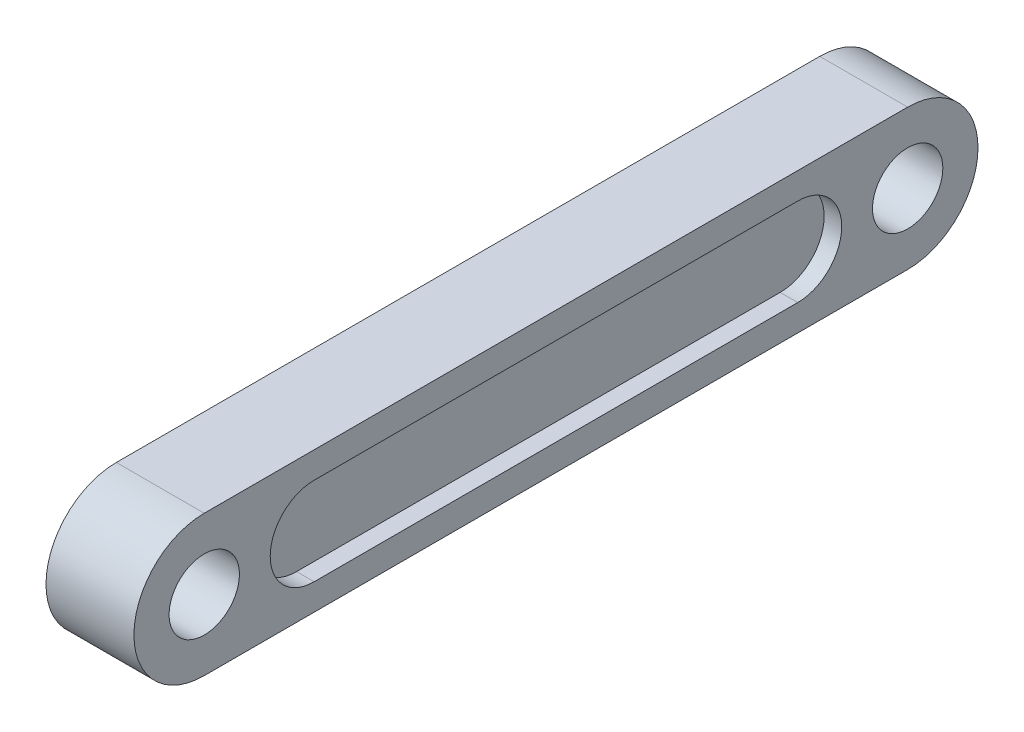
ISO-10303-21;
HEADER;
FILE_DESCRIPTION(('STEP AP214'),'2;1');
FILE_NAME('part.step','',(''),(''),'','','');
FILE_SCHEMA(('AUTOMOTIVE_DESIGN { 1 0 10303 214 1 1 1 1 }'));
ENDSEC;
DATA;
#1=APPLICATION_CONTEXT('core data for automotive mechanical design processes');
#2=APPLICATION_PROTOCOL_DEFINITION('international standard','automotive_design',2000,#1);
#3=PRODUCT_CONTEXT('',#1,'mechanical');
#4=PRODUCT('Part','Part','',(#3));
#5=PRODUCT_RELATED_PRODUCT_CATEGORY('part','',(#4));
#6=PRODUCT_DEFINITION_FORMATION('','',#4);
#7=PRODUCT_DEFINITION_CONTEXT('part definition',#1,'design');
#8=PRODUCT_DEFINITION('design','',#6,#7);
#9=PRODUCT_DEFINITION_SHAPE('','',#8);
#10=(LENGTH_UNIT() NAMED_UNIT(*) SI_UNIT(.MILLI.,.METRE.));
#11=(NAMED_UNIT(*) PLANE_ANGLE_UNIT() SI_UNIT($,.RADIAN.));
#12=(NAMED_UNIT(*) SI_UNIT($,.STERADIAN.) SOLID_ANGLE_UNIT());
#13=UNCERTAINTY_MEASURE_WITH_UNIT(LENGTH_MEASURE(1.E-05),#10,'distance_accuracy_value','');
#14=(GEOMETRIC_REPRESENTATION_CONTEXT(3) GLOBAL_UNCERTAINTY_ASSIGNED_CONTEXT((#13)) GLOBAL_UNIT_ASSIGNED_CONTEXT((#10,
#11,#12)) REPRESENTATION_CONTEXT('',''));
#15=CARTESIAN_POINT('',(0.,0.,0.));
#16=DIRECTION('',(0.,0.,1.));
#17=DIRECTION('',(1.,0.,0.));
#18=AXIS2_PLACEMENT_3D('',#15,#16,#17);
#19=CARTESIAN_POINT('',(5.,0.,0.));
#20=DIRECTION('',(1.,0.,0.));
#21=DIRECTION('',(0.,0.,-1.));
#22=AXIS2_PLACEMENT_3D('',#19,#20,#21);
#23=PLANE('',#22);
#24=CARTESIAN_POINT('',(5.,0.,-40.));
#25=DIRECTION('',(1.,0.,0.));
#26=DIRECTION('',(0.,0.,-1.));
#27=AXIS2_PLACEMENT_3D('',#24,#25,#26);
#28=CIRCLE('',#27,4.00000000000001);
#29=CARTESIAN_POINT('',(5.,0.,-44.));
#30=VERTEX_POINT('',#29);
#31=EDGE_CURVE('E195',#30,#30,#28,.F.);
#32=ORIENTED_EDGE('',*,*,#31,.T.);
#33=EDGE_LOOP('',(#32));
#34=FACE_BOUND('',#33,.T.);
#35=CARTESIAN_POINT('',(5.,0.,40.));
#36=DIRECTION('',(1.,0.,0.));
#37=DIRECTION('',(0.,0.,-1.));
#38=AXIS2_PLACEMENT_3D('',#35,#36,#37);
#39=CIRCLE('',#38,4.00000000000001);
#40=CARTESIAN_POINT('',(5.,0.,36.));
#41=VERTEX_POINT('',#40);
#42=EDGE_CURVE('E198',#41,#41,#39,.T.);
#43=ORIENTED_EDGE('',*,*,#42,.F.);
#44=EDGE_LOOP('',(#43));
#45=FACE_BOUND('',#44,.T.);
#46=DIRECTION('',(0.,0.,-1.));
#47=VECTOR('',#46,1.);
#48=CARTESIAN_POINT('',(5.,-7.99999999999999,0.));
#49=LINE('',#48,#47);
#50=CARTESIAN_POINT('',(5.,-7.99999999999999,40.));
#51=VERTEX_POINT('',#50);
#52=CARTESIAN_POINT('',(5.,-7.99999999999999,-40.));
#53=VERTEX_POINT('',#52);
#54=EDGE_CURVE('E202',#51,#53,#49,.T.);
#55=ORIENTED_EDGE('',*,*,#54,.T.);
#56=CARTESIAN_POINT('',(5.,0.,-40.));
#57=DIRECTION('',(1.,0.,0.));
#58=DIRECTION('',(0.,0.,-1.));
#59=AXIS2_PLACEMENT_3D('',#56,#57,#58);
#60=CIRCLE('',#59,7.99999999999999);
#61=CARTESIAN_POINT('',(5.,7.99999999999998,-40.));
#62=VERTEX_POINT('',#61);
#63=EDGE_CURVE('E205',#53,#62,#60,.T.);
#64=ORIENTED_EDGE('',*,*,#63,.T.);
#65=DIRECTION('',(0.,0.,-1.));
#66=VECTOR('',#65,1.);
#67=CARTESIAN_POINT('',(5.,7.99999999999998,0.));
#68=LINE('',#67,#66);
#69=CARTESIAN_POINT('',(5.,7.99999999999998,40.));
#70=VERTEX_POINT('',#69);
#71=EDGE_CURVE('E207',#70,#62,#68,.T.);
#72=ORIENTED_EDGE('',*,*,#71,.F.);
#73=CARTESIAN_POINT('',(5.,0.,40.));
#74=DIRECTION('',(1.,0.,0.));
#75=DIRECTION('',(0.,0.,-1.));
#76=AXIS2_PLACEMENT_3D('',#73,#74,#75);
#77=CIRCLE('',#76,7.99999999999999);
#78=EDGE_CURVE('E210',#51,#70,#77,.F.);
#79=ORIENTED_EDGE('',*,*,#78,.F.);
#80=EDGE_LOOP('',(#55,#64,#72,#79));
#81=FACE_BOUND('',#80,.T.);
#82=DIRECTION('',(0.,0.,-1.));
#83=VECTOR('',#82,1.);
#84=CARTESIAN_POINT('',(5.,5.,-27.5));
#85=LINE('',#84,#83);
#86=CARTESIAN_POINT('',(5.,5.,27.5));
#87=VERTEX_POINT('',#86);
#88=CARTESIAN_POINT('',(5.,5.,-27.5));
#89=VERTEX_POINT('',#88);
#90=EDGE_CURVE('E155',#87,#89,#85,.T.);
#91=ORIENTED_EDGE('',*,*,#90,.T.);
#92=CARTESIAN_POINT('',(5.,0.,-27.5));
#93=DIRECTION('',(-1.,0.,0.));
#94=DIRECTION('',(0.,0.,1.));
#95=AXIS2_PLACEMENT_3D('',#92,#93,#94);
#96=CIRCLE('',#95,5.);
#97=CARTESIAN_POINT('',(5.,-5.,-27.5));
#98=VERTEX_POINT('',#97);
#99=EDGE_CURVE('E52',#89,#98,#96,.T.);
#100=ORIENTED_EDGE('',*,*,#99,.T.);
#101=DIRECTION('',(0.,0.,1.));
#102=VECTOR('',#101,1.);
#103=CARTESIAN_POINT('',(5.,-5.,-27.5));
#104=LINE('',#103,#102);
#105=CARTESIAN_POINT('',(5.,-4.99999999999999,27.5));
#106=VERTEX_POINT('',#105);
#107=EDGE_CURVE('E146',#98,#106,#104,.T.);
#108=ORIENTED_EDGE('',*,*,#107,.T.);
#109=CARTESIAN_POINT('',(5.,0.,27.5));
#110=DIRECTION('',(-1.,0.,0.));
#111=DIRECTION('',(0.,0.,1.));
#112=AXIS2_PLACEMENT_3D('',#109,#110,#111);
#113=CIRCLE('',#112,5.);
#114=EDGE_CURVE('E149',#106,#87,#113,.T.);
#115=ORIENTED_EDGE('',*,*,#114,.T.);
#116=EDGE_LOOP('',(#91,#100,#108,#115));
#117=FACE_BOUND('',#116,.T.);
#118=ADVANCED_FACE('F37',(#34,#45,#81,#117),#23,.T.);
#119=CARTESIAN_POINT('',(5.,-7.99999999999999,0.));
#120=DIRECTION('',(0.,1.,0.));
#121=DIRECTION('',(0.,0.,1.));
#122=AXIS2_PLACEMENT_3D('',#119,#120,#121);
#123=PLANE('',#122);
#124=DIRECTION('',(0.,0.,-1.));
#125=VECTOR('',#124,1.);
#126=CARTESIAN_POINT('',(-5.,-7.99999999999999,0.));
#127=LINE('',#126,#125);
#128=CARTESIAN_POINT('',(-5.,-7.99999999999999,40.));
#129=VERTEX_POINT('',#128);
#130=CARTESIAN_POINT('',(-5.,-7.99999999999999,-40.));
#131=VERTEX_POINT('',#130);
#132=EDGE_CURVE('E219',#129,#131,#127,.T.);
#133=ORIENTED_EDGE('',*,*,#132,.T.);
#134=DIRECTION('',(-1.,0.,0.));
#135=VECTOR('',#134,1.);
#136=CARTESIAN_POINT('',(5.,-7.99999999999999,-40.));
#137=LINE('',#136,#135);
#138=EDGE_CURVE('E11',#53,#131,#137,.T.);
#139=ORIENTED_EDGE('',*,*,#138,.F.);
#140=ORIENTED_EDGE('',*,*,#54,.F.);
#141=DIRECTION('',(-1.,0.,0.));
#142=VECTOR('',#141,1.);
#143=CARTESIAN_POINT('',(5.,-7.99999999999999,40.));
#144=LINE('',#143,#142);
#145=EDGE_CURVE('E213',#51,#129,#144,.T.);
#146=ORIENTED_EDGE('',*,*,#145,.T.);
#147=EDGE_LOOP('',(#133,#139,#140,#146));
#148=FACE_BOUND('',#147,.T.);
#149=ADVANCED_FACE('F251',(#148),#123,.F.);
#150=CARTESIAN_POINT('',(5.,0.,-40.));
#151=DIRECTION('',(-1.,0.,0.));
#152=DIRECTION('',(0.,0.,1.));
#153=AXIS2_PLACEMENT_3D('',#150,#151,#152);
#154=CYLINDRICAL_SURFACE('',#153,7.99999999999999);
#155=CARTESIAN_POINT('',(-5.,0.,-40.));
#156=DIRECTION('',(1.,0.,0.));
#157=DIRECTION('',(0.,0.,-1.));
#158=AXIS2_PLACEMENT_3D('',#155,#156,#157);
#159=CIRCLE('',#158,7.99999999999999);
#160=CARTESIAN_POINT('',(-5.,7.99999999999998,-40.));
#161=VERTEX_POINT('',#160);
#162=EDGE_CURVE('E222',#131,#161,#159,.T.);
#163=ORIENTED_EDGE('',*,*,#162,.T.);
#164=DIRECTION('',(-1.,0.,0.));
#165=VECTOR('',#164,1.);
#166=CARTESIAN_POINT('',(5.,7.99999999999998,-40.));
#167=LINE('',#166,#165);
#168=EDGE_CURVE('E45',#62,#161,#167,.T.);
#169=ORIENTED_EDGE('',*,*,#168,.F.);
#170=ORIENTED_EDGE('',*,*,#63,.F.);
#171=ORIENTED_EDGE('',*,*,#138,.T.);
#172=EDGE_LOOP('',(#163,#169,#170,#171));
#173=FACE_BOUND('',#172,.T.);
#174=ADVANCED_FACE('F238',(#173),#154,.T.);
#175=CARTESIAN_POINT('',(5.,7.99999999999998,0.));
#176=DIRECTION('',(0.,1.,0.));
#177=DIRECTION('',(0.,0.,1.));
#178=AXIS2_PLACEMENT_3D('',#175,#176,#177);
#179=PLANE('',#178);
#180=DIRECTION('',(0.,0.,-1.));
#181=VECTOR('',#180,1.);
#182=CARTESIAN_POINT('',(-5.,7.99999999999998,0.));
#183=LINE('',#182,#181);
#184=CARTESIAN_POINT('',(-5.,7.99999999999998,40.));
#185=VERTEX_POINT('',#184);
#186=EDGE_CURVE('E225',#185,#161,#183,.T.);
#187=ORIENTED_EDGE('',*,*,#186,.F.);
#188=DIRECTION('',(-1.,0.,0.));
#189=VECTOR('',#188,1.);
#190=CARTESIAN_POINT('',(5.,7.99999999999998,40.));
#191=LINE('',#190,#189);
#192=EDGE_CURVE('E231',#70,#185,#191,.T.);
#193=ORIENTED_EDGE('',*,*,#192,.F.);
#194=ORIENTED_EDGE('',*,*,#71,.T.);
#195=ORIENTED_EDGE('',*,*,#168,.T.);
#196=EDGE_LOOP('',(#187,#193,#194,#195));
#197=FACE_BOUND('',#196,.T.);
#198=ADVANCED_FACE('F235',(#197),#179,.T.);
#199=CARTESIAN_POINT('',(5.,0.,40.));
#200=DIRECTION('',(-1.,0.,0.));
#201=DIRECTION('',(0.,0.,1.));
#202=AXIS2_PLACEMENT_3D('',#199,#200,#201);
#203=CYLINDRICAL_SURFACE('',#202,4.00000000000001);
#204=ORIENTED_EDGE('',*,*,#42,.T.);
#205=EDGE_LOOP('',(#204));
#206=FACE_BOUND('',#205,.T.);
#207=CARTESIAN_POINT('',(-5.,0.,40.));
#208=DIRECTION('',(1.,0.,0.));
#209=DIRECTION('',(0.,0.,-1.));
#210=AXIS2_PLACEMENT_3D('',#207,#208,#209);
#211=CIRCLE('',#210,4.00000000000001);
#212=CARTESIAN_POINT('',(-5.,0.,36.));
#213=VERTEX_POINT('',#212);
#214=EDGE_CURVE('E216',#213,#213,#211,.T.);
#215=ORIENTED_EDGE('',*,*,#214,.F.);
#216=EDGE_LOOP('',(#215));
#217=FACE_BOUND('',#216,.T.);
#218=ADVANCED_FACE('F262',(#206,#217),#203,.F.);
#219=CARTESIAN_POINT('',(5.,0.,-40.));
#220=DIRECTION('',(-1.,0.,0.));
#221=DIRECTION('',(0.,0.,1.));
#222=AXIS2_PLACEMENT_3D('',#219,#220,#221);
#223=CYLINDRICAL_SURFACE('',#222,4.00000000000001);
#224=ORIENTED_EDGE('',*,*,#31,.F.);
#225=EDGE_LOOP('',(#224));
#226=FACE_BOUND('',#225,.T.);
#227=CARTESIAN_POINT('',(-5.,0.,-40.));
#228=DIRECTION('',(1.,0.,0.));
#229=DIRECTION('',(0.,0.,-1.));
#230=AXIS2_PLACEMENT_3D('',#227,#228,#229);
#231=CIRCLE('',#230,4.00000000000001);
#232=CARTESIAN_POINT('',(-5.,0.,-44.));
#233=VERTEX_POINT('',#232);
#234=EDGE_CURVE('E189',#233,#233,#231,.F.);
#235=ORIENTED_EDGE('',*,*,#234,.T.);
#236=EDGE_LOOP('',(#235));
#237=FACE_BOUND('',#236,.T.);
#238=ADVANCED_FACE('F39',(#226,#237),#223,.F.);
#239=CARTESIAN_POINT('',(5.,0.,40.));
#240=DIRECTION('',(-1.,0.,0.));
#241=DIRECTION('',(0.,0.,1.));
#242=AXIS2_PLACEMENT_3D('',#239,#240,#241);
#243=CYLINDRICAL_SURFACE('',#242,7.99999999999999);
#244=CARTESIAN_POINT('',(-5.,0.,40.));
#245=DIRECTION('',(1.,0.,0.));
#246=DIRECTION('',(0.,0.,-1.));
#247=AXIS2_PLACEMENT_3D('',#244,#245,#246);
#248=CIRCLE('',#247,7.99999999999999);
#249=EDGE_CURVE('E199',#129,#185,#248,.F.);
#250=ORIENTED_EDGE('',*,*,#249,.F.);
#251=ORIENTED_EDGE('',*,*,#145,.F.);
#252=ORIENTED_EDGE('',*,*,#78,.T.);
#253=ORIENTED_EDGE('',*,*,#192,.T.);
#254=EDGE_LOOP('',(#250,#251,#252,#253));
#255=FACE_BOUND('',#254,.T.);
#256=ADVANCED_FACE('F245',(#255),#243,.T.);
#257=CARTESIAN_POINT('',(-5.,0.,0.));
#258=DIRECTION('',(1.,0.,0.));
#259=DIRECTION('',(0.,0.,-1.));
#260=AXIS2_PLACEMENT_3D('',#257,#258,#259);
#261=PLANE('',#260);
#262=DIRECTION('',(0.,0.,1.));
#263=VECTOR('',#262,1.);
#264=CARTESIAN_POINT('',(-5.,-5.,-27.5));
#265=LINE('',#264,#263);
#266=CARTESIAN_POINT('',(-5.,-5.,-27.5));
#267=VERTEX_POINT('',#266);
#268=CARTESIAN_POINT('',(-5.,-4.99999999999999,27.5));
#269=VERTEX_POINT('',#268);
#270=EDGE_CURVE('E179',#267,#269,#265,.T.);
#271=ORIENTED_EDGE('',*,*,#270,.F.);
#272=CARTESIAN_POINT('',(-5.,0.,-27.5));
#273=DIRECTION('',(-1.,0.,0.));
#274=DIRECTION('',(0.,0.,1.));
#275=AXIS2_PLACEMENT_3D('',#272,#273,#274);
#276=CIRCLE('',#275,5.);
#277=CARTESIAN_POINT('',(-5.,5.,-27.5));
#278=VERTEX_POINT('',#277);
#279=EDGE_CURVE('E60',#278,#267,#276,.T.);
#280=ORIENTED_EDGE('',*,*,#279,.F.);
#281=DIRECTION('',(0.,0.,-1.));
#282=VECTOR('',#281,1.);
#283=CARTESIAN_POINT('',(-5.,5.,-27.5));
#284=LINE('',#283,#282);
#285=CARTESIAN_POINT('',(-5.,5.,27.5));
#286=VERTEX_POINT('',#285);
#287=EDGE_CURVE('E168',#286,#278,#284,.T.);
#288=ORIENTED_EDGE('',*,*,#287,.F.);
#289=CARTESIAN_POINT('',(-5.,0.,27.5));
#290=DIRECTION('',(-1.,0.,0.));
#291=DIRECTION('',(0.,0.,1.));
#292=AXIS2_PLACEMENT_3D('',#289,#290,#291);
#293=CIRCLE('',#292,5.);
#294=EDGE_CURVE('E182',#269,#286,#293,.T.);
#295=ORIENTED_EDGE('',*,*,#294,.F.);
#296=EDGE_LOOP('',(#271,#280,#288,#295));
#297=FACE_BOUND('',#296,.T.);
#298=ORIENTED_EDGE('',*,*,#234,.F.);
#299=EDGE_LOOP('',(#298));
#300=FACE_BOUND('',#299,.T.);
#301=ORIENTED_EDGE('',*,*,#214,.T.);
#302=EDGE_LOOP('',(#301));
#303=FACE_BOUND('',#302,.T.);
#304=ORIENTED_EDGE('',*,*,#132,.F.);
#305=ORIENTED_EDGE('',*,*,#249,.T.);
#306=ORIENTED_EDGE('',*,*,#186,.T.);
#307=ORIENTED_EDGE('',*,*,#162,.F.);
#308=EDGE_LOOP('',(#304,#305,#306,#307));
#309=FACE_BOUND('',#308,.T.);
#310=ADVANCED_FACE('F242',(#297,#300,#303,#309),#261,.F.);
#311=CARTESIAN_POINT('',(-3.,0.,-27.5));
#312=DIRECTION('',(-1.,0.,0.));
#313=DIRECTION('',(0.,0.,1.));
#314=AXIS2_PLACEMENT_3D('',#311,#312,#313);
#315=CYLINDRICAL_SURFACE('',#314,5.);
#316=ORIENTED_EDGE('',*,*,#279,.T.);
#317=DIRECTION('',(-1.,0.,0.));
#318=VECTOR('',#317,1.);
#319=CARTESIAN_POINT('',(-3.,-5.,-27.5));
#320=LINE('',#319,#318);
#321=CARTESIAN_POINT('',(-3.,-5.,-27.5));
#322=VERTEX_POINT('',#321);
#323=EDGE_CURVE('E177',#322,#267,#320,.T.);
#324=ORIENTED_EDGE('',*,*,#323,.F.);
#325=CARTESIAN_POINT('',(-3.,0.,-27.5));
#326=DIRECTION('',(-1.,0.,0.));
#327=DIRECTION('',(0.,0.,1.));
#328=AXIS2_PLACEMENT_3D('',#325,#326,#327);
#329=CIRCLE('',#328,5.);
#330=CARTESIAN_POINT('',(-3.,5.,-27.5));
#331=VERTEX_POINT('',#330);
#332=EDGE_CURVE('E164',#331,#322,#329,.T.);
#333=ORIENTED_EDGE('',*,*,#332,.F.);
#334=DIRECTION('',(-1.,0.,0.));
#335=VECTOR('',#334,1.);
#336=CARTESIAN_POINT('',(-3.,5.,-27.5));
#337=LINE('',#336,#335);
#338=EDGE_CURVE('E187',#331,#278,#337,.T.);
#339=ORIENTED_EDGE('',*,*,#338,.T.);
#340=EDGE_LOOP('',(#316,#324,#333,#339));
#341=FACE_BOUND('',#340,.T.);
#342=ADVANCED_FACE('F275',(#341),#315,.F.);
#343=CARTESIAN_POINT('',(-3.,5.,-27.5));
#344=DIRECTION('',(0.,1.,0.));
#345=DIRECTION('',(0.,0.,1.));
#346=AXIS2_PLACEMENT_3D('',#343,#344,#345);
#347=PLANE('',#346);
#348=ORIENTED_EDGE('',*,*,#287,.T.);
#349=ORIENTED_EDGE('',*,*,#338,.F.);
#350=DIRECTION('',(0.,0.,-1.));
#351=VECTOR('',#350,1.);
#352=CARTESIAN_POINT('',(-3.,5.,-27.5));
#353=LINE('',#352,#351);
#354=CARTESIAN_POINT('',(-3.,5.,27.5));
#355=VERTEX_POINT('',#354);
#356=EDGE_CURVE('E174',#355,#331,#353,.T.);
#357=ORIENTED_EDGE('',*,*,#356,.F.);
#358=DIRECTION('',(-1.,0.,0.));
#359=VECTOR('',#358,1.);
#360=CARTESIAN_POINT('',(-3.,5.,27.5));
#361=LINE('',#360,#359);
#362=EDGE_CURVE('E190',#355,#286,#361,.T.);
#363=ORIENTED_EDGE('',*,*,#362,.T.);
#364=EDGE_LOOP('',(#348,#349,#357,#363));
#365=FACE_BOUND('',#364,.T.);
#366=ADVANCED_FACE('F282',(#365),#347,.F.);
#367=CARTESIAN_POINT('',(-3.,0.,27.5));
#368=DIRECTION('',(-1.,0.,0.));
#369=DIRECTION('',(0.,0.,1.));
#370=AXIS2_PLACEMENT_3D('',#367,#368,#369);
#371=CYLINDRICAL_SURFACE('',#370,5.);
#372=ORIENTED_EDGE('',*,*,#294,.T.);
#373=ORIENTED_EDGE('',*,*,#362,.F.);
#374=CARTESIAN_POINT('',(-3.,0.,27.5));
#375=DIRECTION('',(-1.,0.,0.));
#376=DIRECTION('',(0.,0.,1.));
#377=AXIS2_PLACEMENT_3D('',#374,#375,#376);
#378=CIRCLE('',#377,5.);
#379=CARTESIAN_POINT('',(-3.,-4.99999999999999,27.5));
#380=VERTEX_POINT('',#379);
#381=EDGE_CURVE('E171',#380,#355,#378,.T.);
#382=ORIENTED_EDGE('',*,*,#381,.F.);
#383=DIRECTION('',(-1.,0.,0.));
#384=VECTOR('',#383,1.);
#385=CARTESIAN_POINT('',(-3.,-4.99999999999999,27.5));
#386=LINE('',#385,#384);
#387=EDGE_CURVE('E192',#380,#269,#386,.T.);
#388=ORIENTED_EDGE('',*,*,#387,.T.);
#389=EDGE_LOOP('',(#372,#373,#382,#388));
#390=FACE_BOUND('',#389,.T.);
#391=ADVANCED_FACE('F292',(#390),#371,.F.);
#392=CARTESIAN_POINT('',(-3.,-5.,-27.5));
#393=DIRECTION('',(0.,-1.,0.));
#394=DIRECTION('',(0.,0.,-1.));
#395=AXIS2_PLACEMENT_3D('',#392,#393,#394);
#396=PLANE('',#395);
#397=ORIENTED_EDGE('',*,*,#270,.T.);
#398=ORIENTED_EDGE('',*,*,#387,.F.);
#399=DIRECTION('',(0.,0.,1.));
#400=VECTOR('',#399,1.);
#401=CARTESIAN_POINT('',(-3.,-5.,-27.5));
#402=LINE('',#401,#400);
#403=EDGE_CURVE('E167',#322,#380,#402,.T.);
#404=ORIENTED_EDGE('',*,*,#403,.F.);
#405=ORIENTED_EDGE('',*,*,#323,.T.);
#406=EDGE_LOOP('',(#397,#398,#404,#405));
#407=FACE_BOUND('',#406,.T.);
#408=ADVANCED_FACE('F288',(#407),#396,.F.);
#409=CARTESIAN_POINT('',(-3.,0.,-27.5));
#410=DIRECTION('',(-1.,0.,0.));
#411=DIRECTION('',(0.,0.,1.));
#412=AXIS2_PLACEMENT_3D('',#409,#410,#411);
#413=PLANE('',#412);
#414=ORIENTED_EDGE('',*,*,#332,.T.);
#415=ORIENTED_EDGE('',*,*,#403,.T.);
#416=ORIENTED_EDGE('',*,*,#381,.T.);
#417=ORIENTED_EDGE('',*,*,#356,.T.);
#418=EDGE_LOOP('',(#414,#415,#416,#417));
#419=FACE_BOUND('',#418,.T.);
#420=ADVANCED_FACE('F291',(#419),#413,.T.);
#421=CARTESIAN_POINT('',(3.,0.,-27.5));
#422=DIRECTION('',(1.,0.,0.));
#423=DIRECTION('',(0.,0.,-1.));
#424=AXIS2_PLACEMENT_3D('',#421,#422,#423);
#425=CYLINDRICAL_SURFACE('',#424,5.);
#426=ORIENTED_EDGE('',*,*,#99,.F.);
#427=DIRECTION('',(1.,0.,0.));
#428=VECTOR('',#427,1.);
#429=CARTESIAN_POINT('',(3.,5.,-27.5));
#430=LINE('',#429,#428);
#431=CARTESIAN_POINT('',(3.,5.,-27.5));
#432=VERTEX_POINT('',#431);
#433=EDGE_CURVE('E131',#432,#89,#430,.T.);
#434=ORIENTED_EDGE('',*,*,#433,.F.);
#435=CARTESIAN_POINT('',(3.,0.,-27.5));
#436=DIRECTION('',(-1.,0.,0.));
#437=DIRECTION('',(0.,0.,1.));
#438=AXIS2_PLACEMENT_3D('',#435,#436,#437);
#439=CIRCLE('',#438,5.);
#440=CARTESIAN_POINT('',(3.,-5.,-27.5));
#441=VERTEX_POINT('',#440);
#442=EDGE_CURVE('E138',#432,#441,#439,.T.);
#443=ORIENTED_EDGE('',*,*,#442,.T.);
#444=DIRECTION('',(1.,0.,0.));
#445=VECTOR('',#444,1.);
#446=CARTESIAN_POINT('',(3.,-5.,-27.5));
#447=LINE('',#446,#445);
#448=EDGE_CURVE('E159',#441,#98,#447,.T.);
#449=ORIENTED_EDGE('',*,*,#448,.T.);
#450=EDGE_LOOP('',(#426,#434,#443,#449));
#451=FACE_BOUND('',#450,.T.);
#452=ADVANCED_FACE('F141',(#451),#425,.F.);
#453=CARTESIAN_POINT('',(3.,-5.,-27.5));
#454=DIRECTION('',(0.,1.,0.));
#455=DIRECTION('',(0.,0.,1.));
#456=AXIS2_PLACEMENT_3D('',#453,#454,#455);
#457=PLANE('',#456);
#458=ORIENTED_EDGE('',*,*,#107,.F.);
#459=ORIENTED_EDGE('',*,*,#448,.F.);
#460=DIRECTION('',(0.,0.,1.));
#461=VECTOR('',#460,1.);
#462=CARTESIAN_POINT('',(3.,-5.,-27.5));
#463=LINE('',#462,#461);
#464=CARTESIAN_POINT('',(3.,-4.99999999999999,27.5));
#465=VERTEX_POINT('',#464);
#466=EDGE_CURVE('E143',#441,#465,#463,.T.);
#467=ORIENTED_EDGE('',*,*,#466,.T.);
#468=DIRECTION('',(1.,0.,0.));
#469=VECTOR('',#468,1.);
#470=CARTESIAN_POINT('',(3.,-4.99999999999999,27.5));
#471=LINE('',#470,#469);
#472=EDGE_CURVE('E161',#465,#106,#471,.T.);
#473=ORIENTED_EDGE('',*,*,#472,.T.);
#474=EDGE_LOOP('',(#458,#459,#467,#473));
#475=FACE_BOUND('',#474,.T.);
#476=ADVANCED_FACE('F305',(#475),#457,.T.);
#477=CARTESIAN_POINT('',(3.,0.,27.5));
#478=DIRECTION('',(1.,0.,0.));
#479=DIRECTION('',(0.,0.,-1.));
#480=AXIS2_PLACEMENT_3D('',#477,#478,#479);
#481=CYLINDRICAL_SURFACE('',#480,5.);
#482=ORIENTED_EDGE('',*,*,#114,.F.);
#483=ORIENTED_EDGE('',*,*,#472,.F.);
#484=CARTESIAN_POINT('',(3.,0.,27.5));
#485=DIRECTION('',(-1.,0.,0.));
#486=DIRECTION('',(0.,0.,1.));
#487=AXIS2_PLACEMENT_3D('',#484,#485,#486);
#488=CIRCLE('',#487,5.);
#489=CARTESIAN_POINT('',(3.,5.,27.5));
#490=VERTEX_POINT('',#489);
#491=EDGE_CURVE('E137',#465,#490,#488,.T.);
#492=ORIENTED_EDGE('',*,*,#491,.T.);
#493=DIRECTION('',(1.,0.,0.));
#494=VECTOR('',#493,1.);
#495=CARTESIAN_POINT('',(3.,5.,27.5));
#496=LINE('',#495,#494);
#497=EDGE_CURVE('E133',#490,#87,#496,.T.);
#498=ORIENTED_EDGE('',*,*,#497,.T.);
#499=EDGE_LOOP('',(#482,#483,#492,#498));
#500=FACE_BOUND('',#499,.T.);
#501=ADVANCED_FACE('F308',(#500),#481,.F.);
#502=CARTESIAN_POINT('',(3.,5.,-27.5));
#503=DIRECTION('',(0.,-1.,0.));
#504=DIRECTION('',(0.,0.,-1.));
#505=AXIS2_PLACEMENT_3D('',#502,#503,#504);
#506=PLANE('',#505);
#507=ORIENTED_EDGE('',*,*,#90,.F.);
#508=ORIENTED_EDGE('',*,*,#497,.F.);
#509=DIRECTION('',(0.,0.,-1.));
#510=VECTOR('',#509,1.);
#511=CARTESIAN_POINT('',(3.,5.,-27.5));
#512=LINE('',#511,#510);
#513=EDGE_CURVE('E128',#490,#432,#512,.T.);
#514=ORIENTED_EDGE('',*,*,#513,.T.);
#515=ORIENTED_EDGE('',*,*,#433,.T.);
#516=EDGE_LOOP('',(#507,#508,#514,#515));
#517=FACE_BOUND('',#516,.T.);
#518=ADVANCED_FACE('F130',(#517),#506,.T.);
#519=CARTESIAN_POINT('',(3.,0.,-27.5));
#520=DIRECTION('',(1.,0.,0.));
#521=DIRECTION('',(0.,0.,1.));
#522=AXIS2_PLACEMENT_3D('',#519,#520,#521);
#523=PLANE('',#522);
#524=ORIENTED_EDGE('',*,*,#442,.F.);
#525=ORIENTED_EDGE('',*,*,#513,.F.);
#526=ORIENTED_EDGE('',*,*,#491,.F.);
#527=ORIENTED_EDGE('',*,*,#466,.F.);
#528=EDGE_LOOP('',(#524,#525,#526,#527));
#529=FACE_BOUND('',#528,.T.);
#530=ADVANCED_FACE('F145',(#529),#523,.T.);
#531=CLOSED_SHELL('',(#118,#149,#174,#198,#218,#238,#256,#310,#342,#366,#391,#408,#420,#452,
#476,#501,#518,#530));
#532=MANIFOLD_SOLID_BREP('B2',#531);
#533=ADVANCED_BREP_SHAPE_REPRESENTATION('',(#18,#532),#14);
#534=SHAPE_DEFINITION_REPRESENTATION(#9,#533);
ENDSEC;
END-ISO-10303-21;
